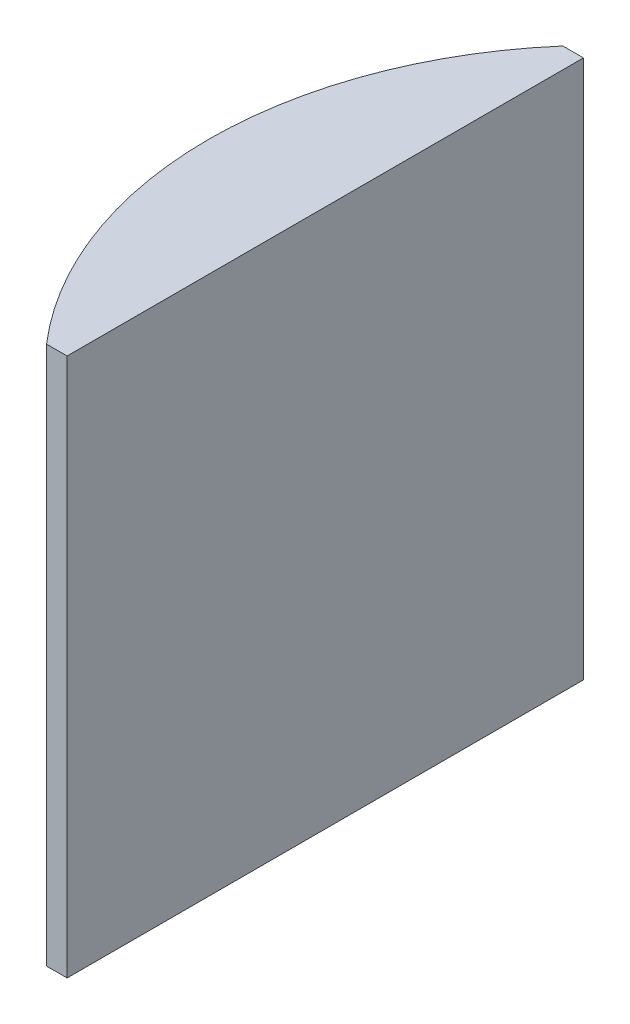
ISO-10303-21;
HEADER;
FILE_DESCRIPTION(('STEP AP214'),'2;1');
FILE_NAME('part.step','',(''),(''),'','','');
FILE_SCHEMA(('AUTOMOTIVE_DESIGN { 1 0 10303 214 1 1 1 1 }'));
ENDSEC;
DATA;
#1=APPLICATION_CONTEXT('core data for automotive mechanical design processes');
#2=APPLICATION_PROTOCOL_DEFINITION('international standard','automotive_design',2000,#1);
#3=PRODUCT_CONTEXT('',#1,'mechanical');
#4=PRODUCT('Part','Part','',(#3));
#5=PRODUCT_RELATED_PRODUCT_CATEGORY('part','',(#4));
#6=PRODUCT_DEFINITION_FORMATION('','',#4);
#7=PRODUCT_DEFINITION_CONTEXT('part definition',#1,'design');
#8=PRODUCT_DEFINITION('design','',#6,#7);
#9=PRODUCT_DEFINITION_SHAPE('','',#8);
#10=(LENGTH_UNIT() NAMED_UNIT(*) SI_UNIT(.MILLI.,.METRE.));
#11=(NAMED_UNIT(*) PLANE_ANGLE_UNIT() SI_UNIT($,.RADIAN.));
#12=(NAMED_UNIT(*) SI_UNIT($,.STERADIAN.) SOLID_ANGLE_UNIT());
#13=UNCERTAINTY_MEASURE_WITH_UNIT(LENGTH_MEASURE(1.E-05),#10,'distance_accuracy_value','');
#14=(GEOMETRIC_REPRESENTATION_CONTEXT(3) GLOBAL_UNCERTAINTY_ASSIGNED_CONTEXT((#13)) GLOBAL_UNIT_ASSIGNED_CONTEXT((#10,
#11,#12)) REPRESENTATION_CONTEXT('',''));
#15=CARTESIAN_POINT('',(0.,0.,0.));
#16=DIRECTION('',(0.,0.,1.));
#17=DIRECTION('',(1.,0.,0.));
#18=AXIS2_PLACEMENT_3D('',#15,#16,#17);
#19=CARTESIAN_POINT('',(4.35520433485127,53.,0.));
#20=DIRECTION('',(0.,-1.,0.));
#21=DIRECTION('',(0.,0.,-1.));
#22=AXIS2_PLACEMENT_3D('',#19,#20,#21);
#23=CYLINDRICAL_SURFACE('',#22,38.78);
#24=CARTESIAN_POINT('',(4.35520433485127,0.,0.));
#25=DIRECTION('',(0.,1.,0.));
#26=DIRECTION('',(0.,0.,1.));
#27=AXIS2_PLACEMENT_3D('',#24,#25,#26);
#28=CIRCLE('',#27,38.78);
#29=CARTESIAN_POINT('',(-24.9488636421379,0.,-25.4));
#30=VERTEX_POINT('',#29);
#31=CARTESIAN_POINT('',(-24.9488636421379,0.,25.4));
#32=VERTEX_POINT('',#31);
#33=EDGE_CURVE('E100',#30,#32,#28,.T.);
#34=ORIENTED_EDGE('',*,*,#33,.T.);
#35=DIRECTION('',(0.,-1.,0.));
#36=VECTOR('',#35,1.);
#37=CARTESIAN_POINT('',(-24.9488636421379,53.,25.4));
#38=LINE('',#37,#36);
#39=CARTESIAN_POINT('',(-24.9488636421379,53.,25.4));
#40=VERTEX_POINT('',#39);
#41=EDGE_CURVE('E11',#40,#32,#38,.T.);
#42=ORIENTED_EDGE('',*,*,#41,.F.);
#43=CARTESIAN_POINT('',(4.35520433485127,53.,0.));
#44=DIRECTION('',(0.,1.,0.));
#45=DIRECTION('',(0.,0.,1.));
#46=AXIS2_PLACEMENT_3D('',#43,#44,#45);
#47=CIRCLE('',#46,38.78);
#48=CARTESIAN_POINT('',(-24.9488636421379,53.,-25.4));
#49=VERTEX_POINT('',#48);
#50=EDGE_CURVE('E88',#49,#40,#47,.T.);
#51=ORIENTED_EDGE('',*,*,#50,.F.);
#52=DIRECTION('',(0.,-1.,0.));
#53=VECTOR('',#52,1.);
#54=CARTESIAN_POINT('',(-24.9488636421379,53.,-25.4));
#55=LINE('',#54,#53);
#56=EDGE_CURVE('E96',#49,#30,#55,.T.);
#57=ORIENTED_EDGE('',*,*,#56,.T.);
#58=EDGE_LOOP('',(#34,#42,#51,#57));
#59=FACE_BOUND('',#58,.T.);
#60=ADVANCED_FACE('F37',(#59),#23,.T.);
#61=CARTESIAN_POINT('',(-24.9488636421379,53.,25.4));
#62=DIRECTION('',(0.,0.,-1.));
#63=DIRECTION('',(-1.,0.,0.));
#64=AXIS2_PLACEMENT_3D('',#61,#62,#63);
#65=PLANE('',#64);
#66=DIRECTION('',(1.,0.,0.));
#67=VECTOR('',#66,1.);
#68=CARTESIAN_POINT('',(-24.9488636421379,0.,25.4));
#69=LINE('',#68,#67);
#70=CARTESIAN_POINT('',(-22.9247956651487,0.,25.4));
#71=VERTEX_POINT('',#70);
#72=EDGE_CURVE('E92',#32,#71,#69,.T.);
#73=ORIENTED_EDGE('',*,*,#72,.T.);
#74=DIRECTION('',(0.,-1.,0.));
#75=VECTOR('',#74,1.);
#76=CARTESIAN_POINT('',(-22.9247956651487,53.,25.4));
#77=LINE('',#76,#75);
#78=CARTESIAN_POINT('',(-22.9247956651487,53.,25.4));
#79=VERTEX_POINT('',#78);
#80=EDGE_CURVE('E45',#79,#71,#77,.T.);
#81=ORIENTED_EDGE('',*,*,#80,.F.);
#82=DIRECTION('',(1.,0.,0.));
#83=VECTOR('',#82,1.);
#84=CARTESIAN_POINT('',(-24.9488636421379,53.,25.4));
#85=LINE('',#84,#83);
#86=EDGE_CURVE('E83',#40,#79,#85,.T.);
#87=ORIENTED_EDGE('',*,*,#86,.F.);
#88=ORIENTED_EDGE('',*,*,#41,.T.);
#89=EDGE_LOOP('',(#73,#81,#87,#88));
#90=FACE_BOUND('',#89,.T.);
#91=ADVANCED_FACE('F91',(#90),#65,.F.);
#92=CARTESIAN_POINT('',(-22.9247956651487,53.,-25.4));
#93=DIRECTION('',(-1.,0.,0.));
#94=DIRECTION('',(0.,0.,1.));
#95=AXIS2_PLACEMENT_3D('',#92,#93,#94);
#96=PLANE('',#95);
#97=DIRECTION('',(0.,0.,-1.));
#98=VECTOR('',#97,1.);
#99=CARTESIAN_POINT('',(-22.9247956651487,0.,-25.4));
#100=LINE('',#99,#98);
#101=CARTESIAN_POINT('',(-22.9247956651487,0.,-25.4));
#102=VERTEX_POINT('',#101);
#103=EDGE_CURVE('E70',#71,#102,#100,.T.);
#104=ORIENTED_EDGE('',*,*,#103,.T.);
#105=DIRECTION('',(0.,-1.,0.));
#106=VECTOR('',#105,1.);
#107=CARTESIAN_POINT('',(-22.9247956651487,53.,-25.4));
#108=LINE('',#107,#106);
#109=CARTESIAN_POINT('',(-22.9247956651487,53.,-25.4));
#110=VERTEX_POINT('',#109);
#111=EDGE_CURVE('E93',#110,#102,#108,.T.);
#112=ORIENTED_EDGE('',*,*,#111,.F.);
#113=DIRECTION('',(0.,0.,-1.));
#114=VECTOR('',#113,1.);
#115=CARTESIAN_POINT('',(-22.9247956651487,53.,-25.4));
#116=LINE('',#115,#114);
#117=EDGE_CURVE('E86',#79,#110,#116,.T.);
#118=ORIENTED_EDGE('',*,*,#117,.F.);
#119=ORIENTED_EDGE('',*,*,#80,.T.);
#120=EDGE_LOOP('',(#104,#112,#118,#119));
#121=FACE_BOUND('',#120,.T.);
#122=ADVANCED_FACE('F94',(#121),#96,.F.);
#123=CARTESIAN_POINT('',(-24.9488636421379,53.,-25.4));
#124=DIRECTION('',(0.,0.,1.));
#125=DIRECTION('',(1.,0.,0.));
#126=AXIS2_PLACEMENT_3D('',#123,#124,#125);
#127=PLANE('',#126);
#128=DIRECTION('',(-1.,0.,0.));
#129=VECTOR('',#128,1.);
#130=CARTESIAN_POINT('',(-24.9488636421379,0.,-25.4));
#131=LINE('',#130,#129);
#132=EDGE_CURVE('E76',#102,#30,#131,.T.);
#133=ORIENTED_EDGE('',*,*,#132,.T.);
#134=ORIENTED_EDGE('',*,*,#56,.F.);
#135=DIRECTION('',(-1.,0.,0.));
#136=VECTOR('',#135,1.);
#137=CARTESIAN_POINT('',(-24.9488636421379,53.,-25.4));
#138=LINE('',#137,#136);
#139=EDGE_CURVE('E53',#110,#49,#138,.T.);
#140=ORIENTED_EDGE('',*,*,#139,.F.);
#141=ORIENTED_EDGE('',*,*,#111,.T.);
#142=EDGE_LOOP('',(#133,#134,#140,#141));
#143=FACE_BOUND('',#142,.T.);
#144=ADVANCED_FACE('F107',(#143),#127,.F.);
#145=CARTESIAN_POINT('',(4.35520433485127,53.,0.));
#146=DIRECTION('',(0.,1.,0.));
#147=DIRECTION('',(0.,0.,1.));
#148=AXIS2_PLACEMENT_3D('',#145,#146,#147);
#149=PLANE('',#148);
#150=ORIENTED_EDGE('',*,*,#50,.T.);
#151=ORIENTED_EDGE('',*,*,#86,.T.);
#152=ORIENTED_EDGE('',*,*,#117,.T.);
#153=ORIENTED_EDGE('',*,*,#139,.T.);
#154=EDGE_LOOP('',(#150,#151,#152,#153));
#155=FACE_BOUND('',#154,.T.);
#156=ADVANCED_FACE('F84',(#155),#149,.T.);
#157=CARTESIAN_POINT('',(4.35520433485127,0.,0.));
#158=DIRECTION('',(0.,1.,0.));
#159=DIRECTION('',(0.,0.,1.));
#160=AXIS2_PLACEMENT_3D('',#157,#158,#159);
#161=PLANE('',#160);
#162=ORIENTED_EDGE('',*,*,#33,.F.);
#163=ORIENTED_EDGE('',*,*,#132,.F.);
#164=ORIENTED_EDGE('',*,*,#103,.F.);
#165=ORIENTED_EDGE('',*,*,#72,.F.);
#166=EDGE_LOOP('',(#162,#163,#164,#165));
#167=FACE_BOUND('',#166,.T.);
#168=ADVANCED_FACE('F110',(#167),#161,.F.);
#169=CLOSED_SHELL('',(#60,#91,#122,#144,#156,#168));
#170=MANIFOLD_SOLID_BREP('B2',#169);
#171=ADVANCED_BREP_SHAPE_REPRESENTATION('',(#18,#170),#14);
#172=SHAPE_DEFINITION_REPRESENTATION(#9,#171);
ENDSEC;
END-ISO-10303-21;
